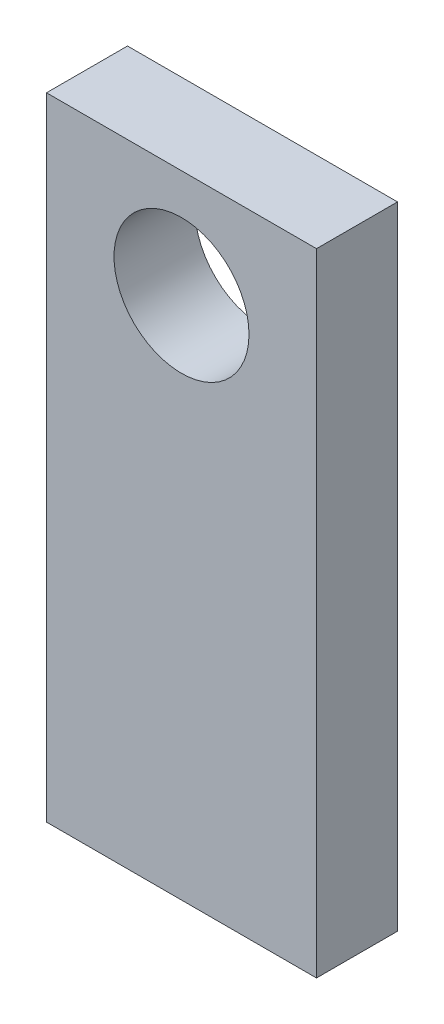
ISO-10303-21;
HEADER;
FILE_DESCRIPTION(('STEP AP214'),'2;1');
FILE_NAME('part.step','',(''),(''),'','','');
FILE_SCHEMA(('AUTOMOTIVE_DESIGN { 1 0 10303 214 1 1 1 1 }'));
ENDSEC;
DATA;
#1=APPLICATION_CONTEXT('core data for automotive mechanical design processes');
#2=APPLICATION_PROTOCOL_DEFINITION('international standard','automotive_design',2000,#1);
#3=PRODUCT_CONTEXT('',#1,'mechanical');
#4=PRODUCT('Part','Part','',(#3));
#5=PRODUCT_RELATED_PRODUCT_CATEGORY('part','',(#4));
#6=PRODUCT_DEFINITION_FORMATION('','',#4);
#7=PRODUCT_DEFINITION_CONTEXT('part definition',#1,'design');
#8=PRODUCT_DEFINITION('design','',#6,#7);
#9=PRODUCT_DEFINITION_SHAPE('','',#8);
#10=(LENGTH_UNIT() NAMED_UNIT(*) SI_UNIT(.MILLI.,.METRE.));
#11=(NAMED_UNIT(*) PLANE_ANGLE_UNIT() SI_UNIT($,.RADIAN.));
#12=(NAMED_UNIT(*) SI_UNIT($,.STERADIAN.) SOLID_ANGLE_UNIT());
#13=UNCERTAINTY_MEASURE_WITH_UNIT(LENGTH_MEASURE(1.E-05),#10,'distance_accuracy_value','');
#14=(GEOMETRIC_REPRESENTATION_CONTEXT(3) GLOBAL_UNCERTAINTY_ASSIGNED_CONTEXT((#13)) GLOBAL_UNIT_ASSIGNED_CONTEXT((#10,
#11,#12)) REPRESENTATION_CONTEXT('',''));
#15=CARTESIAN_POINT('',(0.,0.,0.));
#16=DIRECTION('',(0.,0.,1.));
#17=DIRECTION('',(1.,0.,0.));
#18=AXIS2_PLACEMENT_3D('',#15,#16,#17);
#19=CARTESIAN_POINT('',(0.,0.,19.05));
#20=DIRECTION('',(1.,0.,0.));
#21=DIRECTION('',(0.,0.,-1.));
#22=AXIS2_PLACEMENT_3D('',#19,#20,#21);
#23=PLANE('',#22);
#24=DIRECTION('',(0.,-1.,0.));
#25=VECTOR('',#24,1.);
#26=CARTESIAN_POINT('',(0.,0.,0.));
#27=LINE('',#26,#25);
#28=CARTESIAN_POINT('',(0.,148.55,0.));
#29=VERTEX_POINT('',#28);
#30=CARTESIAN_POINT('',(0.,0.,0.));
#31=VERTEX_POINT('',#30);
#32=EDGE_CURVE('E100',#29,#31,#27,.T.);
#33=ORIENTED_EDGE('',*,*,#32,.T.);
#34=DIRECTION('',(0.,0.,-1.));
#35=VECTOR('',#34,1.);
#36=CARTESIAN_POINT('',(0.,0.,19.05));
#37=LINE('',#36,#35);
#38=CARTESIAN_POINT('',(0.,0.,19.05));
#39=VERTEX_POINT('',#38);
#40=EDGE_CURVE('E11',#39,#31,#37,.T.);
#41=ORIENTED_EDGE('',*,*,#40,.F.);
#42=DIRECTION('',(0.,-1.,0.));
#43=VECTOR('',#42,1.);
#44=CARTESIAN_POINT('',(0.,0.,19.05));
#45=LINE('',#44,#43);
#46=CARTESIAN_POINT('',(0.,148.55,19.05));
#47=VERTEX_POINT('',#46);
#48=EDGE_CURVE('E88',#47,#39,#45,.T.);
#49=ORIENTED_EDGE('',*,*,#48,.F.);
#50=DIRECTION('',(0.,0.,-1.));
#51=VECTOR('',#50,1.);
#52=CARTESIAN_POINT('',(0.,148.55,19.05));
#53=LINE('',#52,#51);
#54=EDGE_CURVE('E96',#47,#29,#53,.T.);
#55=ORIENTED_EDGE('',*,*,#54,.T.);
#56=EDGE_LOOP('',(#33,#41,#49,#55));
#57=FACE_BOUND('',#56,.T.);
#58=ADVANCED_FACE('F37',(#57),#23,.F.);
#59=CARTESIAN_POINT('',(0.,0.,19.05));
#60=DIRECTION('',(0.,1.,0.));
#61=DIRECTION('',(0.,0.,1.));
#62=AXIS2_PLACEMENT_3D('',#59,#60,#61);
#63=PLANE('',#62);
#64=DIRECTION('',(1.,0.,0.));
#65=VECTOR('',#64,1.);
#66=CARTESIAN_POINT('',(0.,0.,0.));
#67=LINE('',#66,#65);
#68=CARTESIAN_POINT('',(63.5,0.,0.));
#69=VERTEX_POINT('',#68);
#70=EDGE_CURVE('E92',#31,#69,#67,.T.);
#71=ORIENTED_EDGE('',*,*,#70,.T.);
#72=DIRECTION('',(0.,0.,-1.));
#73=VECTOR('',#72,1.);
#74=CARTESIAN_POINT('',(63.5,0.,19.05));
#75=LINE('',#74,#73);
#76=CARTESIAN_POINT('',(63.5,0.,19.05));
#77=VERTEX_POINT('',#76);
#78=EDGE_CURVE('E45',#77,#69,#75,.T.);
#79=ORIENTED_EDGE('',*,*,#78,.F.);
#80=DIRECTION('',(1.,0.,0.));
#81=VECTOR('',#80,1.);
#82=CARTESIAN_POINT('',(0.,0.,19.05));
#83=LINE('',#82,#81);
#84=EDGE_CURVE('E83',#39,#77,#83,.T.);
#85=ORIENTED_EDGE('',*,*,#84,.F.);
#86=ORIENTED_EDGE('',*,*,#40,.T.);
#87=EDGE_LOOP('',(#71,#79,#85,#86));
#88=FACE_BOUND('',#87,.T.);
#89=ADVANCED_FACE('F91',(#88),#63,.F.);
#90=CARTESIAN_POINT('',(63.5,0.,19.05));
#91=DIRECTION('',(-1.,0.,0.));
#92=DIRECTION('',(0.,0.,1.));
#93=AXIS2_PLACEMENT_3D('',#90,#91,#92);
#94=PLANE('',#93);
#95=DIRECTION('',(0.,1.,0.));
#96=VECTOR('',#95,1.);
#97=CARTESIAN_POINT('',(63.5,0.,0.));
#98=LINE('',#97,#96);
#99=CARTESIAN_POINT('',(63.5,148.55,0.));
#100=VERTEX_POINT('',#99);
#101=EDGE_CURVE('E70',#69,#100,#98,.T.);
#102=ORIENTED_EDGE('',*,*,#101,.T.);
#103=DIRECTION('',(0.,0.,-1.));
#104=VECTOR('',#103,1.);
#105=CARTESIAN_POINT('',(63.5,148.55,19.05));
#106=LINE('',#105,#104);
#107=CARTESIAN_POINT('',(63.5,148.55,19.05));
#108=VERTEX_POINT('',#107);
#109=EDGE_CURVE('E93',#108,#100,#106,.T.);
#110=ORIENTED_EDGE('',*,*,#109,.F.);
#111=DIRECTION('',(0.,1.,0.));
#112=VECTOR('',#111,1.);
#113=CARTESIAN_POINT('',(63.5,0.,19.05));
#114=LINE('',#113,#112);
#115=EDGE_CURVE('E86',#77,#108,#114,.T.);
#116=ORIENTED_EDGE('',*,*,#115,.F.);
#117=ORIENTED_EDGE('',*,*,#78,.T.);
#118=EDGE_LOOP('',(#102,#110,#116,#117));
#119=FACE_BOUND('',#118,.T.);
#120=ADVANCED_FACE('F94',(#119),#94,.F.);
#121=CARTESIAN_POINT('',(0.,148.55,19.05));
#122=DIRECTION('',(0.,-1.,0.));
#123=DIRECTION('',(0.,0.,-1.));
#124=AXIS2_PLACEMENT_3D('',#121,#122,#123);
#125=PLANE('',#124);
#126=DIRECTION('',(-1.,0.,0.));
#127=VECTOR('',#126,1.);
#128=CARTESIAN_POINT('',(0.,148.55,0.));
#129=LINE('',#128,#127);
#130=EDGE_CURVE('E76',#100,#29,#129,.T.);
#131=ORIENTED_EDGE('',*,*,#130,.T.);
#132=ORIENTED_EDGE('',*,*,#54,.F.);
#133=DIRECTION('',(-1.,0.,0.));
#134=VECTOR('',#133,1.);
#135=CARTESIAN_POINT('',(0.,148.55,19.05));
#136=LINE('',#135,#134);
#137=EDGE_CURVE('E53',#108,#47,#136,.T.);
#138=ORIENTED_EDGE('',*,*,#137,.F.);
#139=ORIENTED_EDGE('',*,*,#109,.T.);
#140=EDGE_LOOP('',(#131,#132,#138,#139));
#141=FACE_BOUND('',#140,.T.);
#142=ADVANCED_FACE('F108',(#141),#125,.F.);
#143=CARTESIAN_POINT('',(0.,0.,19.05));
#144=DIRECTION('',(0.,0.,-1.));
#145=DIRECTION('',(-1.,0.,0.));
#146=AXIS2_PLACEMENT_3D('',#143,#144,#145);
#147=PLANE('',#146);
#148=CARTESIAN_POINT('',(31.75,123.15,19.05));
#149=DIRECTION('',(0.,0.,1.));
#150=DIRECTION('',(1.,0.,0.));
#151=AXIS2_PLACEMENT_3D('',#148,#149,#150);
#152=CIRCLE('',#151,15.875);
#153=CARTESIAN_POINT('',(47.625,123.15,19.05));
#154=VERTEX_POINT('',#153);
#155=EDGE_CURVE('E114',#154,#154,#152,.T.);
#156=ORIENTED_EDGE('',*,*,#155,.F.);
#157=EDGE_LOOP('',(#156));
#158=FACE_BOUND('',#157,.T.);
#159=ORIENTED_EDGE('',*,*,#48,.T.);
#160=ORIENTED_EDGE('',*,*,#84,.T.);
#161=ORIENTED_EDGE('',*,*,#115,.T.);
#162=ORIENTED_EDGE('',*,*,#137,.T.);
#163=EDGE_LOOP('',(#159,#160,#161,#162));
#164=FACE_BOUND('',#163,.T.);
#165=ADVANCED_FACE('F84',(#158,#164),#147,.F.);
#166=CARTESIAN_POINT('',(0.,0.,0.));
#167=DIRECTION('',(0.,0.,-1.));
#168=DIRECTION('',(-1.,0.,0.));
#169=AXIS2_PLACEMENT_3D('',#166,#167,#168);
#170=PLANE('',#169);
#171=CARTESIAN_POINT('',(31.75,123.15,0.));
#172=DIRECTION('',(0.,0.,1.));
#173=DIRECTION('',(1.,0.,0.));
#174=AXIS2_PLACEMENT_3D('',#171,#172,#173);
#175=CIRCLE('',#174,15.875);
#176=CARTESIAN_POINT('',(47.625,123.15,0.));
#177=VERTEX_POINT('',#176);
#178=EDGE_CURVE('E103',#177,#177,#175,.T.);
#179=ORIENTED_EDGE('',*,*,#178,.T.);
#180=EDGE_LOOP('',(#179));
#181=FACE_BOUND('',#180,.T.);
#182=ORIENTED_EDGE('',*,*,#32,.F.);
#183=ORIENTED_EDGE('',*,*,#130,.F.);
#184=ORIENTED_EDGE('',*,*,#101,.F.);
#185=ORIENTED_EDGE('',*,*,#70,.F.);
#186=EDGE_LOOP('',(#182,#183,#184,#185));
#187=FACE_BOUND('',#186,.T.);
#188=ADVANCED_FACE('F111',(#181,#187),#170,.T.);
#189=CARTESIAN_POINT('',(31.75,123.15,0.));
#190=DIRECTION('',(0.,0.,1.));
#191=DIRECTION('',(1.,0.,0.));
#192=AXIS2_PLACEMENT_3D('',#189,#190,#191);
#193=CYLINDRICAL_SURFACE('',#192,15.875);
#194=ORIENTED_EDGE('',*,*,#178,.F.);
#195=EDGE_LOOP('',(#194));
#196=FACE_BOUND('',#195,.T.);
#197=ORIENTED_EDGE('',*,*,#155,.T.);
#198=EDGE_LOOP('',(#197));
#199=FACE_BOUND('',#198,.T.);
#200=ADVANCED_FACE('F121',(#196,#199),#193,.F.);
#201=CLOSED_SHELL('',(#58,#89,#120,#142,#165,#188,#200));
#202=MANIFOLD_SOLID_BREP('B2',#201);
#203=ADVANCED_BREP_SHAPE_REPRESENTATION('',(#18,#202),#14);
#204=SHAPE_DEFINITION_REPRESENTATION(#9,#203);
ENDSEC;
END-ISO-10303-21;
